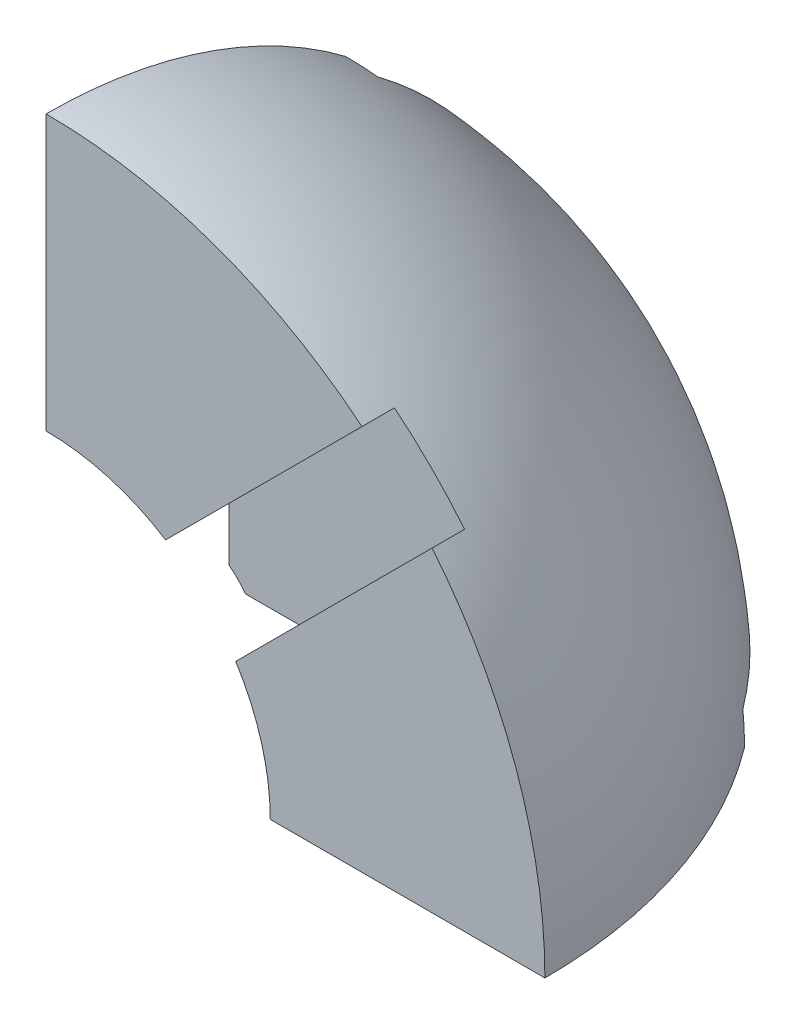
ISO-10303-21;
HEADER;
FILE_DESCRIPTION(('STEP AP214'),'2;1');
FILE_NAME('part.step','',(''),(''),'','','');
FILE_SCHEMA(('AUTOMOTIVE_DESIGN { 1 0 10303 214 1 1 1 1 }'));
ENDSEC;
DATA;
#1=APPLICATION_CONTEXT('core data for automotive mechanical design processes');
#2=APPLICATION_PROTOCOL_DEFINITION('international standard','automotive_design',2000,#1);
#3=PRODUCT_CONTEXT('',#1,'mechanical');
#4=PRODUCT('Part','Part','',(#3));
#5=PRODUCT_RELATED_PRODUCT_CATEGORY('part','',(#4));
#6=PRODUCT_DEFINITION_FORMATION('','',#4);
#7=PRODUCT_DEFINITION_CONTEXT('part definition',#1,'design');
#8=PRODUCT_DEFINITION('design','',#6,#7);
#9=PRODUCT_DEFINITION_SHAPE('','',#8);
#10=(LENGTH_UNIT() NAMED_UNIT(*) SI_UNIT(.MILLI.,.METRE.));
#11=(NAMED_UNIT(*) PLANE_ANGLE_UNIT() SI_UNIT($,.RADIAN.));
#12=(NAMED_UNIT(*) SI_UNIT($,.STERADIAN.) SOLID_ANGLE_UNIT());
#13=UNCERTAINTY_MEASURE_WITH_UNIT(LENGTH_MEASURE(1.E-05),#10,'distance_accuracy_value','');
#14=(GEOMETRIC_REPRESENTATION_CONTEXT(3) GLOBAL_UNCERTAINTY_ASSIGNED_CONTEXT((#13)) GLOBAL_UNIT_ASSIGNED_CONTEXT((#10,
#11,#12)) REPRESENTATION_CONTEXT('',''));
#15=CARTESIAN_POINT('',(0.,0.,0.));
#16=DIRECTION('',(0.,0.,1.));
#17=DIRECTION('',(1.,0.,0.));
#18=AXIS2_PLACEMENT_3D('',#15,#16,#17);
#19=CARTESIAN_POINT('',(0.,0.,0.));
#20=DIRECTION('',(-1.,0.,0.));
#21=DIRECTION('',(0.,1.,0.));
#22=AXIS2_PLACEMENT_3D('',#19,#20,#21);
#23=SPHERICAL_SURFACE('',#22,15.);
#24=CARTESIAN_POINT('',(0.,1.,0.));
#25=DIRECTION('',(0.,-1.,0.));
#26=DIRECTION('',(0.,0.,-1.));
#27=AXIS2_PLACEMENT_3D('',#24,#25,#26);
#28=CIRCLE('',#27,14.9666295470958);
#29=CARTESIAN_POINT('',(11.9761634198785,1.,-8.97616341987848));
#30=VERTEX_POINT('',#29);
#31=CARTESIAN_POINT('',(8.97616341987848,1.,-11.9761634198785));
#32=VERTEX_POINT('',#31);
#33=EDGE_CURVE('E454',#30,#32,#28,.F.);
#34=ORIENTED_EDGE('',*,*,#33,.T.);
#35=CARTESIAN_POINT('',(-1.5,0.,-1.5));
#36=DIRECTION('',(0.707106781186547,0.,0.707106781186548));
#37=DIRECTION('',(0.707106781186548,0.,-0.707106781186547));
#38=AXIS2_PLACEMENT_3D('',#35,#36,#37);
#39=CIRCLE('',#38,14.8492424049175);
#40=CARTESIAN_POINT('',(9.,0.,-12.));
#41=VERTEX_POINT('',#40);
#42=EDGE_CURVE('E304',#32,#41,#39,.F.);
#43=ORIENTED_EDGE('',*,*,#42,.T.);
#44=CARTESIAN_POINT('',(0.,0.,0.));
#45=DIRECTION('',(0.,-1.,0.));
#46=DIRECTION('',(0.,0.,-1.));
#47=AXIS2_PLACEMENT_3D('',#44,#45,#46);
#48=CIRCLE('',#47,15.);
#49=CARTESIAN_POINT('',(0.,0.,-15.));
#50=VERTEX_POINT('',#49);
#51=EDGE_CURVE('E223',#50,#41,#48,.T.);
#52=ORIENTED_EDGE('',*,*,#51,.F.);
#53=CARTESIAN_POINT('',(0.,0.,0.));
#54=DIRECTION('',(-1.,0.,0.));
#55=DIRECTION('',(0.,0.,1.));
#56=AXIS2_PLACEMENT_3D('',#53,#54,#55);
#57=CIRCLE('',#56,15.);
#58=CARTESIAN_POINT('',(0.,9.00000000000001,-12.));
#59=VERTEX_POINT('',#58);
#60=EDGE_CURVE('E248',#59,#50,#57,.T.);
#61=ORIENTED_EDGE('',*,*,#60,.F.);
#62=CARTESIAN_POINT('',(0.,-1.5,-1.49999999999999));
#63=DIRECTION('',(0.,-0.707106781186548,-0.707106781186547));
#64=DIRECTION('',(0.,0.707106781186547,-0.707106781186548));
#65=AXIS2_PLACEMENT_3D('',#62,#63,#64);
#66=CIRCLE('',#65,14.8492424049175);
#67=CARTESIAN_POINT('',(1.,8.97616341987848,-11.9761634198785));
#68=VERTEX_POINT('',#67);
#69=EDGE_CURVE('E453',#68,#59,#66,.F.);
#70=ORIENTED_EDGE('',*,*,#69,.F.);
#71=CARTESIAN_POINT('',(1.,0.,0.));
#72=DIRECTION('',(-1.,0.,0.));
#73=DIRECTION('',(0.,0.,1.));
#74=AXIS2_PLACEMENT_3D('',#71,#72,#73);
#75=CIRCLE('',#74,14.9666295470958);
#76=CARTESIAN_POINT('',(1.,11.9761634198785,-8.97616341987849));
#77=VERTEX_POINT('',#76);
#78=EDGE_CURVE('E485',#68,#77,#75,.F.);
#79=ORIENTED_EDGE('',*,*,#78,.T.);
#80=CARTESIAN_POINT('',(0.,1.49999999999999,1.49999999999999));
#81=DIRECTION('',(0.,-0.707106781186548,-0.707106781186547));
#82=DIRECTION('',(0.,0.707106781186547,-0.707106781186548));
#83=AXIS2_PLACEMENT_3D('',#80,#81,#82);
#84=CIRCLE('',#83,14.8492424049175);
#85=CARTESIAN_POINT('',(0.,12.0000000000002,-8.99999999999976));
#86=VERTEX_POINT('',#85);
#87=EDGE_CURVE('E496',#77,#86,#84,.F.);
#88=ORIENTED_EDGE('',*,*,#87,.T.);
#89=CARTESIAN_POINT('',(0.,15.,0.));
#90=VERTEX_POINT('',#89);
#91=EDGE_CURVE('E249',#90,#86,#57,.T.);
#92=ORIENTED_EDGE('',*,*,#91,.F.);
#93=CARTESIAN_POINT('',(0.,0.,0.));
#94=DIRECTION('',(0.,0.,-1.));
#95=DIRECTION('',(0.,1.,0.));
#96=AXIS2_PLACEMENT_3D('',#93,#94,#95);
#97=CIRCLE('',#96,15.);
#98=CARTESIAN_POINT('',(9.50000000000002,11.6081867662439,0.));
#99=VERTEX_POINT('',#98);
#100=EDGE_CURVE('E241',#90,#99,#97,.T.);
#101=ORIENTED_EDGE('',*,*,#100,.T.);
#102=CARTESIAN_POINT('',(-1.05409338312195,1.05409338312195,0.));
#103=DIRECTION('',(-0.707106781186547,0.707106781186548,0.));
#104=DIRECTION('',(-0.707106781186548,-0.707106781186547,0.));
#105=AXIS2_PLACEMENT_3D('',#102,#103,#104);
#106=CIRCLE('',#105,14.9257420009632);
#107=CARTESIAN_POINT('',(9.47628586644255,11.5844726326864,-0.999999999999997));
#108=VERTEX_POINT('',#107);
#109=EDGE_CURVE('E424',#108,#99,#106,.F.);
#110=ORIENTED_EDGE('',*,*,#109,.F.);
#111=CARTESIAN_POINT('',(0.,0.,-0.999999999999997));
#112=DIRECTION('',(0.,0.,1.));
#113=DIRECTION('',(1.,0.,0.));
#114=AXIS2_PLACEMENT_3D('',#111,#112,#113);
#115=CIRCLE('',#114,14.9666295470958);
#116=CARTESIAN_POINT('',(11.5844726326864,9.47628586644254,-0.999999999999997));
#117=VERTEX_POINT('',#116);
#118=EDGE_CURVE('E515',#108,#117,#115,.F.);
#119=ORIENTED_EDGE('',*,*,#118,.T.);
#120=CARTESIAN_POINT('',(1.05409338312195,-1.05409338312195,0.));
#121=DIRECTION('',(-0.707106781186547,0.707106781186548,0.));
#122=DIRECTION('',(-0.707106781186548,-0.707106781186547,0.));
#123=AXIS2_PLACEMENT_3D('',#120,#121,#122);
#124=CIRCLE('',#123,14.9257420009632);
#125=CARTESIAN_POINT('',(11.6081867662439,9.5,0.));
#126=VERTEX_POINT('',#125);
#127=EDGE_CURVE('E521',#117,#126,#124,.F.);
#128=ORIENTED_EDGE('',*,*,#127,.T.);
#129=CARTESIAN_POINT('',(15.,0.,0.));
#130=VERTEX_POINT('',#129);
#131=EDGE_CURVE('E220',#126,#130,#97,.T.);
#132=ORIENTED_EDGE('',*,*,#131,.T.);
#133=CARTESIAN_POINT('',(12.,0.,-9.));
#134=VERTEX_POINT('',#133);
#135=EDGE_CURVE('E212',#134,#130,#48,.T.);
#136=ORIENTED_EDGE('',*,*,#135,.F.);
#137=CARTESIAN_POINT('',(1.5,0.,1.5));
#138=DIRECTION('',(0.707106781186548,0.,0.707106781186547));
#139=DIRECTION('',(0.707106781186547,0.,-0.707106781186548));
#140=AXIS2_PLACEMENT_3D('',#137,#138,#139);
#141=CIRCLE('',#140,14.8492424049175);
#142=EDGE_CURVE('E194',#30,#134,#141,.F.);
#143=ORIENTED_EDGE('',*,*,#142,.F.);
#144=EDGE_LOOP('',(#34,#43,#52,#61,#70,#79,#88,#92,#101,#110,#119,#128,#132,#136,#143));
#145=FACE_BOUND('',#144,.T.);
#146=ADVANCED_FACE('F38',(#145),#23,.T.);
#147=CARTESIAN_POINT('',(0.,0.,0.));
#148=DIRECTION('',(0.,-1.,0.));
#149=DIRECTION('',(0.,0.,-1.));
#150=AXIS2_PLACEMENT_3D('',#147,#148,#149);
#151=PLANE('',#150);
#152=ORIENTED_EDGE('',*,*,#51,.T.);
#153=DIRECTION('',(-0.707106781186548,0.,0.707106781186547));
#154=VECTOR('',#153,1.);
#155=CARTESIAN_POINT('',(-1.5,0.,-1.5));
#156=LINE('',#155,#154);
#157=CARTESIAN_POINT('',(3.02566036262093,0.,-6.02566036262093));
#158=VERTEX_POINT('',#157);
#159=EDGE_CURVE('E216',#41,#158,#156,.T.);
#160=ORIENTED_EDGE('',*,*,#159,.T.);
#161=CARTESIAN_POINT('',(0.,0.,0.));
#162=DIRECTION('',(0.,-1.,0.));
#163=DIRECTION('',(0.,0.,-1.));
#164=AXIS2_PLACEMENT_3D('',#161,#162,#163);
#165=CIRCLE('',#164,6.74264068711929);
#166=CARTESIAN_POINT('',(0.,0.,-6.74264068711929));
#167=VERTEX_POINT('',#166);
#168=EDGE_CURVE('E322',#167,#158,#165,.T.);
#169=ORIENTED_EDGE('',*,*,#168,.F.);
#170=DIRECTION('',(0.,0.,-1.));
#171=VECTOR('',#170,1.);
#172=CARTESIAN_POINT('',(0.,0.,0.));
#173=LINE('',#172,#171);
#174=EDGE_CURVE('E229',#167,#50,#173,.T.);
#175=ORIENTED_EDGE('',*,*,#174,.T.);
#176=EDGE_LOOP('',(#152,#160,#169,#175));
#177=FACE_BOUND('',#176,.T.);
#178=ADVANCED_FACE('F386',(#177),#151,.T.);
#179=CARTESIAN_POINT('',(0.,0.,0.));
#180=DIRECTION('',(0.,-1.,0.));
#181=DIRECTION('',(0.,0.,1.));
#182=AXIS2_PLACEMENT_3D('',#179,#180,#181);
#183=SPHERICAL_SURFACE('',#182,6.74264068711929);
#184=ORIENTED_EDGE('',*,*,#168,.T.);
#185=CARTESIAN_POINT('',(-1.5,0.,-1.5));
#186=DIRECTION('',(0.707106781186547,0.,0.707106781186548));
#187=DIRECTION('',(0.707106781186548,0.,-0.707106781186547));
#188=AXIS2_PLACEMENT_3D('',#185,#186,#187);
#189=CIRCLE('',#188,6.40025026351286);
#190=CARTESIAN_POINT('',(3.01182753751339,0.500027978285282,-6.0118275375134));
#191=VERTEX_POINT('',#190);
#192=EDGE_CURVE('E457',#158,#191,#189,.T.);
#193=ORIENTED_EDGE('',*,*,#192,.T.);
#194=CARTESIAN_POINT('',(4.63686977199275,1.11038169210382,-4.76756695296637));
#195=CARTESIAN_POINT('',(4.57719921159137,1.05869085447477,-4.8376491363737));
#196=CARTESIAN_POINT('',(4.51438188953742,1.0092268757405,-4.90674923822128));
#197=CARTESIAN_POINT('',(4.38254898032727,0.915507297643772,-5.04276497983304));
#198=CARTESIAN_POINT('',(4.31352431815962,0.871259549923068,-5.10967721966664));
#199=CARTESIAN_POINT('',(4.16902901416115,0.78858731204365,-5.24136193971706));
#200=CARTESIAN_POINT('',(4.09351529684011,0.750207330952664,-5.30611540659265));
#201=CARTESIAN_POINT('',(3.93689743987453,0.680610672734169,-5.4325085673771));
#202=CARTESIAN_POINT('',(3.85579702121187,0.649389286532662,-5.49415028732295));
#203=CARTESIAN_POINT('',(3.64358771657519,0.580490294689324,-5.64598676370884));
#204=CARTESIAN_POINT('',(3.50892256957444,0.54828417490556,-5.73382894875738));
#205=CARTESIAN_POINT('',(3.23039141657394,0.506676373732184,-5.89894885154182));
#206=CARTESIAN_POINT('',(3.08655754429354,0.497199107179631,-5.97626077643281));
#207=CARTESIAN_POINT('',(2.81549274093602,0.503711348746555,-6.10750506905705));
#208=CARTESIAN_POINT('',(2.689038406537,0.516068027297215,-6.16320496370228));
#209=CARTESIAN_POINT('',(2.43534253360285,0.561199880476602,-6.26390361317584));
#210=CARTESIAN_POINT('',(2.30810077945468,0.593980917091554,-6.30889929066645));
#211=CARTESIAN_POINT('',(2.05632285541004,0.681096815074539,-6.38672190269653));
#212=CARTESIAN_POINT('',(1.93180664252482,0.735555505909321,-6.41947679279824));
#213=CARTESIAN_POINT('',(1.69118575313913,0.865599770468686,-6.47094762465389));
#214=CARTESIAN_POINT('',(1.57507497995203,0.941169834258349,-6.48967383584152));
#215=CARTESIAN_POINT('',(1.36826078720843,1.10193332393196,-6.51092420383107));
#216=CARTESIAN_POINT('',(1.27616759282931,1.18514103841652,-6.51500985284035));
#217=CARTESIAN_POINT('',(1.10547411193041,1.36413682607172,-6.51118601971656));
#218=CARTESIAN_POINT('',(1.02686965053478,1.45992099046565,-6.50328025650676));
#219=CARTESIAN_POINT('',(0.888505442534113,1.65635427568232,-6.47643508503675));
#220=CARTESIAN_POINT('',(0.828058422700755,1.75659230020057,-6.45800663993862));
#221=CARTESIAN_POINT('',(0.722453171851422,1.9626067591205,-6.41119247780595));
#222=CARTESIAN_POINT('',(0.677296352292865,2.06838370378669,-6.38280584201062));
#223=CARTESIAN_POINT('',(0.600747464272165,2.28748806159751,-6.3154550116933));
#224=CARTESIAN_POINT('',(0.570089876031586,2.4009382621341,-6.27606176447543));
#225=CARTESIAN_POINT('',(0.525176411907554,2.62767755717762,-6.18853724501488));
#226=CARTESIAN_POINT('',(0.510926694236386,2.740966575267,-6.14040269982458));
#227=CARTESIAN_POINT('',(0.496952760079804,2.97812935525689,-6.03042904552486));
#228=CARTESIAN_POINT('',(0.49914250952821,3.10167328606238,-5.96764282130148));
#229=CARTESIAN_POINT('',(0.52065130018437,3.34278854915233,-5.83412594483623));
#230=CARTESIAN_POINT('',(0.539978963414774,3.46035684363284,-5.76339130942176));
#231=CARTESIAN_POINT('',(0.598133724357301,3.70688047134292,-5.60273243301742));
#232=CARTESIAN_POINT('',(0.639711770791261,3.83438575834793,-5.5115881788703));
#233=CARTESIAN_POINT('',(0.739888771722207,4.07661106943627,-5.32195442236767));
#234=CARTESIAN_POINT('',(0.798497498255285,4.19132370078121,-5.22346072715767));
#235=CARTESIAN_POINT('',(0.901041822752656,4.35995327826249,-5.06463617677526));
#236=CARTESIAN_POINT('',(0.940321103574115,4.41866463761679,-5.00627511466847));
#237=CARTESIAN_POINT('',(1.02264224624261,4.5313074254305,-4.8880459229929));
#238=CARTESIAN_POINT('',(1.0656722549648,4.5852528996162,-4.8281829384037));
#239=CARTESIAN_POINT('',(1.11038169210382,4.63686977199275,-4.76756695296637));
#240=B_SPLINE_CURVE_WITH_KNOTS('',3,(#194,#195,#196,#197,#198,#199,#200,#201,#202,#203,#204,
#205,#206,#207,#208,#209,#210,#211,#212,#213,#214,#215,#216,#217,#218,#219,#220,#221,#222,#223,
#224,#225,#226,#227,#228,#229,#230,#231,#232,#233,#234,#235,#236,#237,#238,#239),.UNSPECIFIED.,
.F.,.F.,(4,2,2,2,2,2,2,2,2,2,2,2,2,2,2,2,2,2,2,2,2,2,4),(0.,0.316674287409151,0.633819316240205,
0.953261913688335,1.27249376832043,1.76238693999139,2.25064869120507,2.6651086576616,
3.07968763292575,3.49666960058281,3.91334602526578,4.28398602854311,4.65451110791419,
5.00841177761283,5.36234510742203,5.73267284755889,6.10313953407727,6.51735325771207,
6.93177548908856,7.41647696350952,7.90145710588743,8.17615495670898,8.4500141652659),.UNSPECIFIED.);
#241=CARTESIAN_POINT('',(0.500027978285282,3.0118275375134,-6.01182753751339));
#242=VERTEX_POINT('',#241);
#243=EDGE_CURVE('E309',#191,#242,#240,.T.);
#244=ORIENTED_EDGE('',*,*,#243,.T.);
#245=CARTESIAN_POINT('',(0.,-1.5,-1.49999999999999));
#246=DIRECTION('',(0.,-0.707106781186548,-0.707106781186547));
#247=DIRECTION('',(0.,0.707106781186547,-0.707106781186548));
#248=AXIS2_PLACEMENT_3D('',#245,#246,#247);
#249=CIRCLE('',#248,6.40025026351286);
#250=CARTESIAN_POINT('',(0.,3.02566036262094,-6.02566036262093));
#251=VERTEX_POINT('',#250);
#252=EDGE_CURVE('E442',#251,#242,#249,.T.);
#253=ORIENTED_EDGE('',*,*,#252,.F.);
#254=CARTESIAN_POINT('',(0.,0.,0.));
#255=DIRECTION('',(1.,0.,0.));
#256=DIRECTION('',(0.,0.,-1.));
#257=AXIS2_PLACEMENT_3D('',#254,#255,#256);
#258=CIRCLE('',#257,6.74264068711929);
#259=EDGE_CURVE('E428',#251,#167,#258,.F.);
#260=ORIENTED_EDGE('',*,*,#259,.T.);
#261=EDGE_LOOP('',(#184,#193,#244,#253,#260));
#262=FACE_BOUND('',#261,.T.);
#263=ADVANCED_FACE('F354',(#262),#183,.F.);
#264=CARTESIAN_POINT('',(3.,13.,-3.));
#265=DIRECTION('',(0.,-1.,0.));
#266=DIRECTION('',(0.,0.,-1.));
#267=AXIS2_PLACEMENT_3D('',#264,#265,#266);
#268=CYLINDRICAL_SURFACE('',#267,2.5);
#269=CARTESIAN_POINT('',(3.,1.,-3.));
#270=DIRECTION('',(0.,-1.,0.));
#271=DIRECTION('',(0.,0.,-1.));
#272=AXIS2_PLACEMENT_3D('',#269,#270,#271);
#273=CIRCLE('',#272,2.5);
#274=CARTESIAN_POINT('',(5.,1.,-4.5));
#275=VERTEX_POINT('',#274);
#276=CARTESIAN_POINT('',(4.5,1.,-5.));
#277=VERTEX_POINT('',#276);
#278=EDGE_CURVE('E54',#275,#277,#273,.F.);
#279=ORIENTED_EDGE('',*,*,#278,.F.);
#280=CARTESIAN_POINT('',(3.,3.,-3.));
#281=DIRECTION('',(-0.707106781186547,-0.707106781186547,0.));
#282=DIRECTION('',(-0.707106781186547,0.707106781186547,0.));
#283=AXIS2_PLACEMENT_3D('',#280,#281,#282);
#284=ELLIPSE('',#283,3.53553390593274,2.5);
#285=CARTESIAN_POINT('',(4.76776695296637,1.23223304703363,-4.76776695296637));
#286=VERTEX_POINT('',#285);
#287=EDGE_CURVE('E269',#286,#275,#284,.T.);
#288=ORIENTED_EDGE('',*,*,#287,.F.);
#289=CARTESIAN_POINT('',(3.,3.,-3.));
#290=DIRECTION('',(0.,-0.707106781186547,0.707106781186547));
#291=DIRECTION('',(0.,0.707106781186547,0.707106781186547));
#292=AXIS2_PLACEMENT_3D('',#289,#290,#291);
#293=ELLIPSE('',#292,3.53553390593274,2.5);
#294=EDGE_CURVE('E566',#277,#286,#293,.T.);
#295=ORIENTED_EDGE('',*,*,#294,.F.);
#296=EDGE_LOOP('',(#279,#288,#295));
#297=FACE_BOUND('',#296,.T.);
#298=ADVANCED_FACE('F370',(#297),#268,.F.);
#299=CARTESIAN_POINT('',(3.,3.,-13.));
#300=DIRECTION('',(0.,0.,1.));
#301=DIRECTION('',(1.,0.,0.));
#302=AXIS2_PLACEMENT_3D('',#299,#300,#301);
#303=CYLINDRICAL_SURFACE('',#302,2.5);
#304=CARTESIAN_POINT('',(3.,3.,-13.));
#305=DIRECTION('',(0.,0.,1.));
#306=DIRECTION('',(1.,0.,0.));
#307=AXIS2_PLACEMENT_3D('',#304,#305,#306);
#308=CIRCLE('',#307,2.5);
#309=CARTESIAN_POINT('',(5.5,3.,-13.));
#310=VERTEX_POINT('',#309);
#311=EDGE_CURVE('E224',#310,#310,#308,.T.);
#312=ORIENTED_EDGE('',*,*,#311,.F.);
#313=EDGE_LOOP('',(#312));
#314=FACE_BOUND('',#313,.T.);
#315=CARTESIAN_POINT('',(3.,3.,-6.));
#316=DIRECTION('',(0.707106781186547,0.,0.707106781186548));
#317=DIRECTION('',(-0.707106781186548,0.,0.707106781186547));
#318=AXIS2_PLACEMENT_3D('',#315,#316,#317);
#319=ELLIPSE('',#318,3.53553390593274,2.5);
#320=CARTESIAN_POINT('',(4.5,1.,-7.5));
#321=VERTEX_POINT('',#320);
#322=EDGE_CURVE('E11',#321,#191,#319,.F.);
#323=ORIENTED_EDGE('',*,*,#322,.F.);
#324=DIRECTION('',(0.,0.,1.));
#325=VECTOR('',#324,1.);
#326=CARTESIAN_POINT('',(4.5,1.,-13.));
#327=LINE('',#326,#325);
#328=EDGE_CURVE('E47',#277,#321,#327,.F.);
#329=ORIENTED_EDGE('',*,*,#328,.F.);
#330=ORIENTED_EDGE('',*,*,#294,.T.);
#331=CARTESIAN_POINT('',(3.,3.,-3.));
#332=DIRECTION('',(0.707106781186547,0.,0.707106781186547));
#333=DIRECTION('',(-0.707106781186547,0.,0.707106781186547));
#334=AXIS2_PLACEMENT_3D('',#331,#332,#333);
#335=ELLIPSE('',#334,3.53553390593274,2.5);
#336=CARTESIAN_POINT('',(4.76776695296637,4.76776695296637,-4.76776695296637));
#337=VERTEX_POINT('',#336);
#338=EDGE_CURVE('E253',#286,#337,#335,.T.);
#339=ORIENTED_EDGE('',*,*,#338,.T.);
#340=CARTESIAN_POINT('',(3.,3.,-3.));
#341=DIRECTION('',(0.,0.707106781186547,0.707106781186547));
#342=DIRECTION('',(0.,-0.707106781186547,0.707106781186547));
#343=AXIS2_PLACEMENT_3D('',#340,#341,#342);
#344=ELLIPSE('',#343,3.53553390593274,2.5);
#345=CARTESIAN_POINT('',(1.23223304703363,4.76776695296637,-4.76776695296637));
#346=VERTEX_POINT('',#345);
#347=EDGE_CURVE('E562',#337,#346,#344,.T.);
#348=ORIENTED_EDGE('',*,*,#347,.T.);
#349=CARTESIAN_POINT('',(3.,3.,-3.));
#350=DIRECTION('',(-0.707106781186547,0.,0.707106781186547));
#351=DIRECTION('',(0.707106781186547,0.,0.707106781186547));
#352=AXIS2_PLACEMENT_3D('',#349,#350,#351);
#353=ELLIPSE('',#352,3.53553390593274,2.5);
#354=CARTESIAN_POINT('',(1.,4.5,-5.));
#355=VERTEX_POINT('',#354);
#356=EDGE_CURVE('E257',#346,#355,#353,.T.);
#357=ORIENTED_EDGE('',*,*,#356,.T.);
#358=DIRECTION('',(0.,0.,1.));
#359=VECTOR('',#358,1.);
#360=CARTESIAN_POINT('',(1.,4.5,-13.));
#361=LINE('',#360,#359);
#362=CARTESIAN_POINT('',(1.,4.5,-7.5));
#363=VERTEX_POINT('',#362);
#364=EDGE_CURVE('E62',#363,#355,#361,.T.);
#365=ORIENTED_EDGE('',*,*,#364,.F.);
#366=CARTESIAN_POINT('',(3.,3.,-5.99999999999999));
#367=DIRECTION('',(0.,-0.707106781186548,-0.707106781186547));
#368=DIRECTION('',(0.,-0.707106781186547,0.707106781186548));
#369=AXIS2_PLACEMENT_3D('',#366,#367,#368);
#370=ELLIPSE('',#369,3.53553390593274,2.5);
#371=EDGE_CURVE('E286',#363,#242,#370,.F.);
#372=ORIENTED_EDGE('',*,*,#371,.T.);
#373=ORIENTED_EDGE('',*,*,#243,.F.);
#374=EDGE_LOOP('',(#323,#329,#330,#339,#348,#357,#365,#372,#373));
#375=FACE_BOUND('',#374,.T.);
#376=ADVANCED_FACE('F308',(#314,#375),#303,.F.);
#377=CARTESIAN_POINT('',(0.,0.,0.));
#378=DIRECTION('',(-1.,0.,0.));
#379=DIRECTION('',(0.,0.,1.));
#380=AXIS2_PLACEMENT_3D('',#377,#378,#379);
#381=PLANE('',#380);
#382=ORIENTED_EDGE('',*,*,#91,.T.);
#383=DIRECTION('',(0.,-0.707106781186547,0.707106781186548));
#384=VECTOR('',#383,1.);
#385=CARTESIAN_POINT('',(0.,1.49999999999999,1.49999999999999));
#386=LINE('',#385,#384);
#387=CARTESIAN_POINT('',(0.,6.02566036262093,-3.02566036262094));
#388=VERTEX_POINT('',#387);
#389=EDGE_CURVE('E205',#86,#388,#386,.T.);
#390=ORIENTED_EDGE('',*,*,#389,.T.);
#391=CARTESIAN_POINT('',(0.,6.74264068711929,0.));
#392=VERTEX_POINT('',#391);
#393=EDGE_CURVE('E433',#392,#388,#258,.F.);
#394=ORIENTED_EDGE('',*,*,#393,.F.);
#395=DIRECTION('',(0.,1.,0.));
#396=VECTOR('',#395,1.);
#397=CARTESIAN_POINT('',(0.,0.,0.));
#398=LINE('',#397,#396);
#399=EDGE_CURVE('E245',#392,#90,#398,.T.);
#400=ORIENTED_EDGE('',*,*,#399,.T.);
#401=EDGE_LOOP('',(#382,#390,#394,#400));
#402=FACE_BOUND('',#401,.T.);
#403=ADVANCED_FACE('F352',(#402),#381,.T.);
#404=ORIENTED_EDGE('',*,*,#393,.T.);
#405=CARTESIAN_POINT('',(0.,1.49999999999999,1.49999999999999));
#406=DIRECTION('',(0.,-0.707106781186548,-0.707106781186547));
#407=DIRECTION('',(0.,0.707106781186547,-0.707106781186548));
#408=AXIS2_PLACEMENT_3D('',#405,#406,#407);
#409=CIRCLE('',#408,6.40025026351286);
#410=CARTESIAN_POINT('',(0.500027978285282,6.01182753751339,-3.0118275375134));
#411=VERTEX_POINT('',#410);
#412=EDGE_CURVE('E492',#388,#411,#409,.T.);
#413=ORIENTED_EDGE('',*,*,#412,.T.);
#414=CARTESIAN_POINT('',(1.11038169210382,4.76756695296637,-4.63686977199275));
#415=CARTESIAN_POINT('',(1.05869085447477,4.8376491363737,-4.57719921159137));
#416=CARTESIAN_POINT('',(1.0092268757405,4.90674923822128,-4.51438188953742));
#417=CARTESIAN_POINT('',(0.915507297643772,5.04276497983304,-4.38254898032727));
#418=CARTESIAN_POINT('',(0.871259549923068,5.10967721966664,-4.31352431815962));
#419=CARTESIAN_POINT('',(0.788587312043649,5.24136193971706,-4.16902901416115));
#420=CARTESIAN_POINT('',(0.750207330952664,5.30611540659265,-4.09351529684011));
#421=CARTESIAN_POINT('',(0.680610672734169,5.4325085673771,-3.93689743987453));
#422=CARTESIAN_POINT('',(0.649389286532662,5.49415028732295,-3.85579702121187));
#423=CARTESIAN_POINT('',(0.580490294689323,5.64598676370884,-3.64358771657519));
#424=CARTESIAN_POINT('',(0.548284174905559,5.73382894875738,-3.50892256957444));
#425=CARTESIAN_POINT('',(0.506676373732184,5.89894885154182,-3.23039141657393));
#426=CARTESIAN_POINT('',(0.497199107179631,5.97626077643281,-3.08655754429354));
#427=CARTESIAN_POINT('',(0.503711348746555,6.10750506905705,-2.81549274093602));
#428=CARTESIAN_POINT('',(0.516068027297215,6.16320496370228,-2.689038406537));
#429=CARTESIAN_POINT('',(0.561199880476601,6.26390361317584,-2.43534253360285));
#430=CARTESIAN_POINT('',(0.593980917091554,6.30889929066645,-2.30810077945468));
#431=CARTESIAN_POINT('',(0.681096815074539,6.38672190269653,-2.05632285541004));
#432=CARTESIAN_POINT('',(0.735555505909321,6.41947679279823,-1.93180664252482));
#433=CARTESIAN_POINT('',(0.865599770468685,6.47094762465389,-1.69118575313913));
#434=CARTESIAN_POINT('',(0.941169834258348,6.48967383584152,-1.57507497995204));
#435=CARTESIAN_POINT('',(1.10193332393196,6.51092420383107,-1.36826078720843));
#436=CARTESIAN_POINT('',(1.18514103841652,6.51500985284035,-1.27616759282931));
#437=CARTESIAN_POINT('',(1.36413682607172,6.51118601971656,-1.10547411193041));
#438=CARTESIAN_POINT('',(1.45992099046565,6.50328025650676,-1.02686965053478));
#439=CARTESIAN_POINT('',(1.65635427568232,6.47643508503675,-0.888505442534115));
#440=CARTESIAN_POINT('',(1.75659230020057,6.45800663993862,-0.828058422700757));
#441=CARTESIAN_POINT('',(1.9626067591205,6.41119247780595,-0.722453171851424));
#442=CARTESIAN_POINT('',(2.06838370378669,6.38280584201062,-0.677296352292865));
#443=CARTESIAN_POINT('',(2.2874880615975,6.3154550116933,-0.600747464272166));
#444=CARTESIAN_POINT('',(2.4009382621341,6.27606176447543,-0.570089876031586));
#445=CARTESIAN_POINT('',(2.62767755717762,6.18853724501488,-0.525176411907554));
#446=CARTESIAN_POINT('',(2.740966575267,6.14040269982458,-0.510926694236386));
#447=CARTESIAN_POINT('',(2.97812935525689,6.03042904552487,-0.496952760079804));
#448=CARTESIAN_POINT('',(3.10167328606238,5.96764282130148,-0.49914250952821));
#449=CARTESIAN_POINT('',(3.34278854915233,5.83412594483624,-0.52065130018437));
#450=CARTESIAN_POINT('',(3.46035684363284,5.76339130942176,-0.539978963414773));
#451=CARTESIAN_POINT('',(3.70688047134292,5.60273243301742,-0.5981337243573));
#452=CARTESIAN_POINT('',(3.83438575834793,5.51158817887031,-0.639711770791261));
#453=CARTESIAN_POINT('',(4.07661106943627,5.32195442236767,-0.739888771722208));
#454=CARTESIAN_POINT('',(4.19132370078121,5.22346072715767,-0.798497498255285));
#455=CARTESIAN_POINT('',(4.35995327826249,5.06463617677526,-0.901041822752655));
#456=CARTESIAN_POINT('',(4.41866463761679,5.00627511466847,-0.940321103574115));
#457=CARTESIAN_POINT('',(4.5313074254305,4.8880459229929,-1.02264224624261));
#458=CARTESIAN_POINT('',(4.5852528996162,4.8281829384037,-1.0656722549648));
#459=CARTESIAN_POINT('',(4.63686977199275,4.76756695296637,-1.11038169210382));
#460=B_SPLINE_CURVE_WITH_KNOTS('',3,(#414,#415,#416,#417,#418,#419,#420,#421,#422,#423,#424,
#425,#426,#427,#428,#429,#430,#431,#432,#433,#434,#435,#436,#437,#438,#439,#440,#441,#442,#443,
#444,#445,#446,#447,#448,#449,#450,#451,#452,#453,#454,#455,#456,#457,#458,#459),.UNSPECIFIED.,
.F.,.F.,(4,2,2,2,2,2,2,2,2,2,2,2,2,2,2,2,2,2,2,2,2,2,4),(0.,0.316674287409153,0.633819316240206,
0.953261913688336,1.27249376832043,1.76238693999139,2.25064869120507,2.6651086576616,
3.07968763292575,3.49666960058281,3.91334602526578,4.2839860285431,4.65451110791419,
5.00841177761282,5.36234510742203,5.73267284755889,6.10313953407726,6.51735325771207,
6.93177548908855,7.41647696350951,7.90145710588743,8.17615495670898,8.4500141652659),.UNSPECIFIED.);
#461=CARTESIAN_POINT('',(3.57832327115225,5.68651003739615,-0.567811233879294));
#462=VERTEX_POINT('',#461);
#463=EDGE_CURVE('E314',#411,#462,#460,.T.);
#464=ORIENTED_EDGE('',*,*,#463,.T.);
#465=CARTESIAN_POINT('',(-1.05409338312195,1.05409338312195,0.));
#466=DIRECTION('',(-0.707106781186547,0.707106781186548,0.));
#467=DIRECTION('',(-0.707106781186548,-0.707106781186547,0.));
#468=AXIS2_PLACEMENT_3D('',#465,#466,#467);
#469=CIRCLE('',#468,6.57578723157262);
#470=CARTESIAN_POINT('',(3.59569035996296,5.70387712620686,0.));
#471=VERTEX_POINT('',#470);
#472=EDGE_CURVE('E429',#471,#462,#469,.T.);
#473=ORIENTED_EDGE('',*,*,#472,.F.);
#474=CARTESIAN_POINT('',(0.,0.,0.));
#475=DIRECTION('',(0.,0.,1.));
#476=DIRECTION('',(1.,0.,0.));
#477=AXIS2_PLACEMENT_3D('',#474,#475,#476);
#478=CIRCLE('',#477,6.74264068711929);
#479=EDGE_CURVE('E423',#392,#471,#478,.F.);
#480=ORIENTED_EDGE('',*,*,#479,.F.);
#481=EDGE_LOOP('',(#404,#413,#464,#473,#480));
#482=FACE_BOUND('',#481,.T.);
#483=ADVANCED_FACE('F346',(#482),#183,.F.);
#484=CARTESIAN_POINT('',(3.,13.,-3.));
#485=DIRECTION('',(0.,-1.,0.));
#486=DIRECTION('',(0.,0.,-1.));
#487=AXIS2_PLACEMENT_3D('',#484,#485,#486);
#488=CIRCLE('',#487,2.5);
#489=CARTESIAN_POINT('',(3.,13.,-5.5));
#490=VERTEX_POINT('',#489);
#491=EDGE_CURVE('E319',#490,#490,#488,.T.);
#492=ORIENTED_EDGE('',*,*,#491,.F.);
#493=EDGE_LOOP('',(#492));
#494=FACE_BOUND('',#493,.T.);
#495=CARTESIAN_POINT('',(3.,5.99999999999999,-3.));
#496=DIRECTION('',(0.,-0.707106781186548,-0.707106781186547));
#497=DIRECTION('',(0.,-0.707106781186547,0.707106781186548));
#498=AXIS2_PLACEMENT_3D('',#495,#496,#497);
#499=ELLIPSE('',#498,3.53553390593274,2.5);
#500=CARTESIAN_POINT('',(1.,7.49999999999999,-4.5));
#501=VERTEX_POINT('',#500);
#502=EDGE_CURVE('E290',#501,#411,#499,.F.);
#503=ORIENTED_EDGE('',*,*,#502,.F.);
#504=DIRECTION('',(0.,-1.,0.));
#505=VECTOR('',#504,1.);
#506=CARTESIAN_POINT('',(1.,13.,-4.5));
#507=LINE('',#506,#505);
#508=CARTESIAN_POINT('',(1.,5.,-4.5));
#509=VERTEX_POINT('',#508);
#510=EDGE_CURVE('E482',#509,#501,#507,.F.);
#511=ORIENTED_EDGE('',*,*,#510,.F.);
#512=CARTESIAN_POINT('',(3.,3.,-3.));
#513=DIRECTION('',(-0.707106781186547,-0.707106781186547,0.));
#514=DIRECTION('',(-0.707106781186547,0.707106781186547,0.));
#515=AXIS2_PLACEMENT_3D('',#512,#513,#514);
#516=ELLIPSE('',#515,3.53553390593274,2.5);
#517=EDGE_CURVE('E558',#346,#509,#516,.F.);
#518=ORIENTED_EDGE('',*,*,#517,.F.);
#519=ORIENTED_EDGE('',*,*,#347,.F.);
#520=CARTESIAN_POINT('',(3.,3.,-3.));
#521=DIRECTION('',(-0.707106781186547,0.707106781186547,0.));
#522=DIRECTION('',(-0.707106781186547,-0.707106781186547,0.));
#523=AXIS2_PLACEMENT_3D('',#520,#521,#522);
#524=ELLIPSE('',#523,3.53553390593274,2.5);
#525=CARTESIAN_POINT('',(4.76776695296637,4.76776695296637,-1.23223304703363));
#526=VERTEX_POINT('',#525);
#527=EDGE_CURVE('E265',#526,#337,#524,.T.);
#528=ORIENTED_EDGE('',*,*,#527,.F.);
#529=CARTESIAN_POINT('',(3.,3.,-3.));
#530=DIRECTION('',(0.,-0.707106781186547,0.707106781186547));
#531=DIRECTION('',(0.,0.707106781186547,0.707106781186547));
#532=AXIS2_PLACEMENT_3D('',#529,#530,#531);
#533=ELLIPSE('',#532,3.53553390593274,2.5);
#534=CARTESIAN_POINT('',(4.5,5.,-0.999999999999997));
#535=VERTEX_POINT('',#534);
#536=EDGE_CURVE('E535',#535,#526,#533,.F.);
#537=ORIENTED_EDGE('',*,*,#536,.F.);
#538=DIRECTION('',(0.,-1.,0.));
#539=VECTOR('',#538,1.);
#540=CARTESIAN_POINT('',(4.5,13.,-0.999999999999997));
#541=LINE('',#540,#539);
#542=CARTESIAN_POINT('',(4.5,6.6081867662439,-0.999999999999997));
#543=VERTEX_POINT('',#542);
#544=EDGE_CURVE('E512',#543,#535,#541,.T.);
#545=ORIENTED_EDGE('',*,*,#544,.F.);
#546=CARTESIAN_POINT('',(3.,5.1081867662439,-3.));
#547=DIRECTION('',(-0.707106781186547,0.707106781186548,0.));
#548=DIRECTION('',(-0.707106781186548,-0.707106781186547,0.));
#549=AXIS2_PLACEMENT_3D('',#546,#547,#548);
#550=ELLIPSE('',#549,3.53553390593274,2.5);
#551=EDGE_CURVE('E279',#543,#462,#550,.F.);
#552=ORIENTED_EDGE('',*,*,#551,.T.);
#553=ORIENTED_EDGE('',*,*,#463,.F.);
#554=EDGE_LOOP('',(#503,#511,#518,#519,#528,#537,#545,#552,#553));
#555=FACE_BOUND('',#554,.T.);
#556=ADVANCED_FACE('F351',(#494,#555),#268,.F.);
#557=CARTESIAN_POINT('',(13.,3.,-3.));
#558=DIRECTION('',(-1.,0.,0.));
#559=DIRECTION('',(0.,0.,1.));
#560=AXIS2_PLACEMENT_3D('',#557,#558,#559);
#561=CYLINDRICAL_SURFACE('',#560,2.5);
#562=CARTESIAN_POINT('',(1.,3.,-3.));
#563=DIRECTION('',(-1.,0.,0.));
#564=DIRECTION('',(0.,0.,1.));
#565=AXIS2_PLACEMENT_3D('',#562,#563,#564);
#566=CIRCLE('',#565,2.5);
#567=EDGE_CURVE('E283',#355,#509,#566,.F.);
#568=ORIENTED_EDGE('',*,*,#567,.F.);
#569=ORIENTED_EDGE('',*,*,#356,.F.);
#570=ORIENTED_EDGE('',*,*,#517,.T.);
#571=EDGE_LOOP('',(#568,#569,#570));
#572=FACE_BOUND('',#571,.T.);
#573=ADVANCED_FACE('F368',(#572),#561,.F.);
#574=CARTESIAN_POINT('',(0.,0.,0.));
#575=DIRECTION('',(0.,0.,-1.));
#576=DIRECTION('',(0.,1.,0.));
#577=AXIS2_PLACEMENT_3D('',#574,#575,#576);
#578=PLANE('',#577);
#579=DIRECTION('',(-0.707106781186548,-0.707106781186547,0.));
#580=VECTOR('',#579,1.);
#581=CARTESIAN_POINT('',(1.05409338312195,-1.05409338312195,0.));
#582=LINE('',#581,#580);
#583=CARTESIAN_POINT('',(5.70387712620686,3.59569035996296,0.));
#584=VERTEX_POINT('',#583);
#585=EDGE_CURVE('E411',#126,#584,#582,.T.);
#586=ORIENTED_EDGE('',*,*,#585,.T.);
#587=CARTESIAN_POINT('',(6.74264068711929,0.,0.));
#588=VERTEX_POINT('',#587);
#589=EDGE_CURVE('E413',#584,#588,#478,.F.);
#590=ORIENTED_EDGE('',*,*,#589,.T.);
#591=DIRECTION('',(1.,0.,0.));
#592=VECTOR('',#591,1.);
#593=CARTESIAN_POINT('',(0.,0.,0.));
#594=LINE('',#593,#592);
#595=EDGE_CURVE('E238',#588,#130,#594,.T.);
#596=ORIENTED_EDGE('',*,*,#595,.T.);
#597=ORIENTED_EDGE('',*,*,#131,.F.);
#598=EDGE_LOOP('',(#586,#590,#596,#597));
#599=FACE_BOUND('',#598,.T.);
#600=ADVANCED_FACE('F376',(#599),#578,.F.);
#601=CARTESIAN_POINT('',(1.5,0.,1.5));
#602=DIRECTION('',(0.707106781186548,0.,0.707106781186547));
#603=DIRECTION('',(0.707106781186547,0.,-0.707106781186548));
#604=AXIS2_PLACEMENT_3D('',#601,#602,#603);
#605=CIRCLE('',#604,6.40025026351286);
#606=CARTESIAN_POINT('',(6.02566036262093,0.,-3.02566036262093));
#607=VERTEX_POINT('',#606);
#608=CARTESIAN_POINT('',(6.0118275375134,0.500027978285282,-3.0118275375134));
#609=VERTEX_POINT('',#608);
#610=EDGE_CURVE('E206',#607,#609,#605,.T.);
#611=ORIENTED_EDGE('',*,*,#610,.F.);
#612=EDGE_CURVE('E214',#607,#588,#165,.T.);
#613=ORIENTED_EDGE('',*,*,#612,.T.);
#614=ORIENTED_EDGE('',*,*,#589,.F.);
#615=CARTESIAN_POINT('',(1.05409338312195,-1.05409338312195,0.));
#616=DIRECTION('',(-0.707106781186547,0.707106781186548,0.));
#617=DIRECTION('',(-0.707106781186548,-0.707106781186547,0.));
#618=AXIS2_PLACEMENT_3D('',#615,#616,#617);
#619=CIRCLE('',#618,6.57578723157262);
#620=CARTESIAN_POINT('',(5.68651003739615,3.57832327115225,-0.567811233879293));
#621=VERTEX_POINT('',#620);
#622=EDGE_CURVE('E420',#584,#621,#619,.T.);
#623=ORIENTED_EDGE('',*,*,#622,.T.);
#624=CARTESIAN_POINT('',(4.76756695296637,4.63686977199275,-1.11038169210382));
#625=CARTESIAN_POINT('',(4.8376491363737,4.57719921159137,-1.05869085447477));
#626=CARTESIAN_POINT('',(4.90674923822128,4.51438188953742,-1.0092268757405));
#627=CARTESIAN_POINT('',(5.04276497983304,4.38254898032727,-0.915507297643772));
#628=CARTESIAN_POINT('',(5.10967721966664,4.31352431815962,-0.871259549923069));
#629=CARTESIAN_POINT('',(5.24136193971706,4.16902901416115,-0.78858731204365));
#630=CARTESIAN_POINT('',(5.30611540659265,4.09351529684011,-0.750207330952664));
#631=CARTESIAN_POINT('',(5.4325085673771,3.93689743987453,-0.680610672734169));
#632=CARTESIAN_POINT('',(5.49415028732295,3.85579702121187,-0.649389286532663));
#633=CARTESIAN_POINT('',(5.64598676370884,3.64358771657519,-0.580490294689325));
#634=CARTESIAN_POINT('',(5.73382894875738,3.50892256957444,-0.54828417490556));
#635=CARTESIAN_POINT('',(5.89894885154182,3.23039141657393,-0.506676373732184));
#636=CARTESIAN_POINT('',(5.97626077643281,3.08655754429354,-0.497199107179631));
#637=CARTESIAN_POINT('',(6.10750506905705,2.81549274093602,-0.503711348746556));
#638=CARTESIAN_POINT('',(6.16320496370228,2.689038406537,-0.516068027297216));
#639=CARTESIAN_POINT('',(6.26390361317584,2.43534253360285,-0.561199880476603));
#640=CARTESIAN_POINT('',(6.30889929066645,2.30810077945468,-0.593980917091555));
#641=CARTESIAN_POINT('',(6.38672190269653,2.05632285541004,-0.681096815074539));
#642=CARTESIAN_POINT('',(6.41947679279823,1.93180664252482,-0.735555505909321));
#643=CARTESIAN_POINT('',(6.47094762465389,1.69118575313913,-0.865599770468686));
#644=CARTESIAN_POINT('',(6.48967383584152,1.57507497995204,-0.941169834258349));
#645=CARTESIAN_POINT('',(6.51092420383107,1.36826078720843,-1.10193332393196));
#646=CARTESIAN_POINT('',(6.51500985284035,1.27616759282931,-1.18514103841652));
#647=CARTESIAN_POINT('',(6.51118601971656,1.10547411193041,-1.36413682607172));
#648=CARTESIAN_POINT('',(6.50328025650677,1.02686965053478,-1.45992099046565));
#649=CARTESIAN_POINT('',(6.47643508503675,0.888505442534115,-1.65635427568232));
#650=CARTESIAN_POINT('',(6.45800663993862,0.828058422700757,-1.75659230020057));
#651=CARTESIAN_POINT('',(6.41119247780595,0.722453171851424,-1.9626067591205));
#652=CARTESIAN_POINT('',(6.38280584201062,0.677296352292866,-2.06838370378669));
#653=CARTESIAN_POINT('',(6.3154550116933,0.600747464272166,-2.2874880615975));
#654=CARTESIAN_POINT('',(6.27606176447543,0.570089876031587,-2.4009382621341));
#655=CARTESIAN_POINT('',(6.18853724501488,0.525176411907556,-2.62767755717762));
#656=CARTESIAN_POINT('',(6.14040269982458,0.510926694236387,-2.740966575267));
#657=CARTESIAN_POINT('',(6.03042904552487,0.496952760079804,-2.97812935525689));
#658=CARTESIAN_POINT('',(5.96764282130148,0.499142509528211,-3.10167328606238));
#659=CARTESIAN_POINT('',(5.83412594483623,0.520651300184371,-3.34278854915233));
#660=CARTESIAN_POINT('',(5.76339130942176,0.539978963414775,-3.46035684363284));
#661=CARTESIAN_POINT('',(5.60273243301742,0.598133724357301,-3.70688047134292));
#662=CARTESIAN_POINT('',(5.5115881788703,0.639711770791262,-3.83438575834793));
#663=CARTESIAN_POINT('',(5.32195442236767,0.739888771722209,-4.07661106943627));
#664=CARTESIAN_POINT('',(5.22346072715767,0.798497498255286,-4.19132370078122));
#665=CARTESIAN_POINT('',(5.06463617677526,0.901041822752657,-4.35995327826249));
#666=CARTESIAN_POINT('',(5.00627511466847,0.940321103574116,-4.41866463761679));
#667=CARTESIAN_POINT('',(4.8880459229929,1.02264224624262,-4.5313074254305));
#668=CARTESIAN_POINT('',(4.8281829384037,1.0656722549648,-4.58525289961619));
#669=CARTESIAN_POINT('',(4.76756695296637,1.11038169210382,-4.63686977199275));
#670=B_SPLINE_CURVE_WITH_KNOTS('',3,(#624,#625,#626,#627,#628,#629,#630,#631,#632,#633,#634,
#635,#636,#637,#638,#639,#640,#641,#642,#643,#644,#645,#646,#647,#648,#649,#650,#651,#652,#653,
#654,#655,#656,#657,#658,#659,#660,#661,#662,#663,#664,#665,#666,#667,#668,#669),.UNSPECIFIED.,
.F.,.F.,(4,2,2,2,2,2,2,2,2,2,2,2,2,2,2,2,2,2,2,2,2,2,4),(0.,0.316674287409153,0.633819316240206,
0.953261913688335,1.27249376832043,1.76238693999139,2.25064869120507,2.6651086576616,
3.07968763292575,3.49666960058281,3.91334602526578,4.2839860285431,4.65451110791419,
5.00841177761282,5.36234510742203,5.73267284755889,6.10313953407726,6.51735325771207,
6.93177548908855,7.41647696350951,7.90145710588743,8.17615495670898,8.4500141652659),.UNSPECIFIED.);
#671=EDGE_CURVE('E315',#621,#609,#670,.T.);
#672=ORIENTED_EDGE('',*,*,#671,.T.);
#673=EDGE_LOOP('',(#611,#613,#614,#623,#672));
#674=FACE_BOUND('',#673,.T.);
#675=ADVANCED_FACE('F355',(#674),#183,.F.);
#676=CARTESIAN_POINT('',(13.,3.,-3.));
#677=DIRECTION('',(-1.,0.,0.));
#678=DIRECTION('',(0.,0.,1.));
#679=AXIS2_PLACEMENT_3D('',#676,#677,#678);
#680=CIRCLE('',#679,2.5);
#681=CARTESIAN_POINT('',(13.,3.,-0.5));
#682=VERTEX_POINT('',#681);
#683=EDGE_CURVE('E231',#682,#682,#680,.T.);
#684=ORIENTED_EDGE('',*,*,#683,.F.);
#685=EDGE_LOOP('',(#684));
#686=FACE_BOUND('',#685,.T.);
#687=DIRECTION('',(-1.,0.,0.));
#688=VECTOR('',#687,1.);
#689=CARTESIAN_POINT('',(13.,1.,-4.5));
#690=LINE('',#689,#688);
#691=CARTESIAN_POINT('',(7.5,1.,-4.5));
#692=VERTEX_POINT('',#691);
#693=EDGE_CURVE('E594',#692,#275,#690,.T.);
#694=ORIENTED_EDGE('',*,*,#693,.F.);
#695=CARTESIAN_POINT('',(6.,3.,-3.));
#696=DIRECTION('',(0.707106781186548,0.,0.707106781186547));
#697=DIRECTION('',(-0.707106781186547,0.,0.707106781186548));
#698=AXIS2_PLACEMENT_3D('',#695,#696,#697);
#699=ELLIPSE('',#698,3.53553390593274,2.5);
#700=EDGE_CURVE('E456',#692,#609,#699,.F.);
#701=ORIENTED_EDGE('',*,*,#700,.T.);
#702=ORIENTED_EDGE('',*,*,#671,.F.);
#703=CARTESIAN_POINT('',(5.1081867662439,3.,-3.));
#704=DIRECTION('',(-0.707106781186547,0.707106781186548,0.));
#705=DIRECTION('',(-0.707106781186548,-0.707106781186547,0.));
#706=AXIS2_PLACEMENT_3D('',#703,#704,#705);
#707=ELLIPSE('',#706,3.53553390593274,2.5);
#708=CARTESIAN_POINT('',(6.6081867662439,4.5,-0.999999999999997));
#709=VERTEX_POINT('',#708);
#710=EDGE_CURVE('E276',#709,#621,#707,.F.);
#711=ORIENTED_EDGE('',*,*,#710,.F.);
#712=DIRECTION('',(-1.,0.,0.));
#713=VECTOR('',#712,1.);
#714=CARTESIAN_POINT('',(13.,4.5,-0.999999999999997));
#715=LINE('',#714,#713);
#716=CARTESIAN_POINT('',(5.,4.5,-0.999999999999998));
#717=VERTEX_POINT('',#716);
#718=EDGE_CURVE('E507',#717,#709,#715,.F.);
#719=ORIENTED_EDGE('',*,*,#718,.F.);
#720=CARTESIAN_POINT('',(3.,3.,-3.));
#721=DIRECTION('',(-0.707106781186547,0.,0.707106781186547));
#722=DIRECTION('',(0.707106781186547,0.,0.707106781186547));
#723=AXIS2_PLACEMENT_3D('',#720,#721,#722);
#724=ELLIPSE('',#723,3.53553390593274,2.5);
#725=EDGE_CURVE('E261',#526,#717,#724,.F.);
#726=ORIENTED_EDGE('',*,*,#725,.F.);
#727=ORIENTED_EDGE('',*,*,#527,.T.);
#728=ORIENTED_EDGE('',*,*,#338,.F.);
#729=ORIENTED_EDGE('',*,*,#287,.T.);
#730=EDGE_LOOP('',(#694,#701,#702,#711,#719,#726,#727,#728,#729));
#731=FACE_BOUND('',#730,.T.);
#732=ADVANCED_FACE('F378',(#686,#731),#561,.F.);
#733=CARTESIAN_POINT('',(3.,3.,-0.999999999999997));
#734=DIRECTION('',(0.,0.,1.));
#735=DIRECTION('',(1.,0.,0.));
#736=AXIS2_PLACEMENT_3D('',#733,#734,#735);
#737=CIRCLE('',#736,2.5);
#738=EDGE_CURVE('E273',#535,#717,#737,.F.);
#739=ORIENTED_EDGE('',*,*,#738,.F.);
#740=ORIENTED_EDGE('',*,*,#536,.T.);
#741=ORIENTED_EDGE('',*,*,#725,.T.);
#742=EDGE_LOOP('',(#739,#740,#741));
#743=FACE_BOUND('',#742,.T.);
#744=ADVANCED_FACE('F342',(#743),#303,.F.);
#745=DIRECTION('',(0.,-0.707106781186547,0.707106781186548));
#746=VECTOR('',#745,1.);
#747=CARTESIAN_POINT('',(0.,-1.5,-1.49999999999999));
#748=LINE('',#747,#746);
#749=EDGE_CURVE('E448',#59,#251,#748,.T.);
#750=ORIENTED_EDGE('',*,*,#749,.F.);
#751=ORIENTED_EDGE('',*,*,#60,.T.);
#752=ORIENTED_EDGE('',*,*,#174,.F.);
#753=ORIENTED_EDGE('',*,*,#259,.F.);
#754=EDGE_LOOP('',(#750,#751,#752,#753));
#755=FACE_BOUND('',#754,.T.);
#756=ADVANCED_FACE('F40',(#755),#381,.T.);
#757=ORIENTED_EDGE('',*,*,#479,.T.);
#758=DIRECTION('',(-0.707106781186548,-0.707106781186547,0.));
#759=VECTOR('',#758,1.);
#760=CARTESIAN_POINT('',(-1.05409338312195,1.05409338312195,0.));
#761=LINE('',#760,#759);
#762=EDGE_CURVE('E417',#99,#471,#761,.T.);
#763=ORIENTED_EDGE('',*,*,#762,.F.);
#764=ORIENTED_EDGE('',*,*,#100,.F.);
#765=ORIENTED_EDGE('',*,*,#399,.F.);
#766=EDGE_LOOP('',(#757,#763,#764,#765));
#767=FACE_BOUND('',#766,.T.);
#768=ADVANCED_FACE('F385',(#767),#578,.F.);
#769=DIRECTION('',(-0.707106781186547,0.,0.707106781186548));
#770=VECTOR('',#769,1.);
#771=CARTESIAN_POINT('',(1.5,0.,1.5));
#772=LINE('',#771,#770);
#773=EDGE_CURVE('E197',#134,#607,#772,.T.);
#774=ORIENTED_EDGE('',*,*,#773,.F.);
#775=ORIENTED_EDGE('',*,*,#135,.T.);
#776=ORIENTED_EDGE('',*,*,#595,.F.);
#777=ORIENTED_EDGE('',*,*,#612,.F.);
#778=EDGE_LOOP('',(#774,#775,#776,#777));
#779=FACE_BOUND('',#778,.T.);
#780=ADVANCED_FACE('F210',(#779),#151,.T.);
#781=CARTESIAN_POINT('',(3.,3.,-13.));
#782=DIRECTION('',(0.,0.,1.));
#783=DIRECTION('',(1.,0.,0.));
#784=AXIS2_PLACEMENT_3D('',#781,#782,#783);
#785=PLANE('',#784);
#786=ORIENTED_EDGE('',*,*,#311,.T.);
#787=EDGE_LOOP('',(#786));
#788=FACE_BOUND('',#787,.T.);
#789=ADVANCED_FACE('F372',(#788),#785,.T.);
#790=CARTESIAN_POINT('',(13.,3.,-3.));
#791=DIRECTION('',(-1.,0.,0.));
#792=DIRECTION('',(0.,0.,1.));
#793=AXIS2_PLACEMENT_3D('',#790,#791,#792);
#794=PLANE('',#793);
#795=ORIENTED_EDGE('',*,*,#683,.T.);
#796=EDGE_LOOP('',(#795));
#797=FACE_BOUND('',#796,.T.);
#798=ADVANCED_FACE('F363',(#797),#794,.T.);
#799=CARTESIAN_POINT('',(3.,13.,-3.));
#800=DIRECTION('',(0.,-1.,0.));
#801=DIRECTION('',(0.,0.,-1.));
#802=AXIS2_PLACEMENT_3D('',#799,#800,#801);
#803=PLANE('',#802);
#804=ORIENTED_EDGE('',*,*,#491,.T.);
#805=EDGE_LOOP('',(#804));
#806=FACE_BOUND('',#805,.T.);
#807=ADVANCED_FACE('F358',(#806),#803,.T.);
#808=CARTESIAN_POINT('',(0.,0.,-0.999999999999997));
#809=DIRECTION('',(0.,0.,1.));
#810=DIRECTION('',(1.,0.,0.));
#811=AXIS2_PLACEMENT_3D('',#808,#809,#810);
#812=PLANE('',#811);
#813=DIRECTION('',(-0.707106781186548,-0.707106781186547,0.));
#814=VECTOR('',#813,1.);
#815=CARTESIAN_POINT('',(-1.05409338312195,1.05409338312195,-0.999999999999997));
#816=LINE('',#815,#814);
#817=EDGE_CURVE('E416',#108,#543,#816,.T.);
#818=ORIENTED_EDGE('',*,*,#817,.T.);
#819=ORIENTED_EDGE('',*,*,#544,.T.);
#820=ORIENTED_EDGE('',*,*,#738,.T.);
#821=ORIENTED_EDGE('',*,*,#718,.T.);
#822=DIRECTION('',(-0.707106781186548,-0.707106781186547,0.));
#823=VECTOR('',#822,1.);
#824=CARTESIAN_POINT('',(1.05409338312195,-1.05409338312195,-0.999999999999997));
#825=LINE('',#824,#823);
#826=EDGE_CURVE('E503',#117,#709,#825,.T.);
#827=ORIENTED_EDGE('',*,*,#826,.F.);
#828=ORIENTED_EDGE('',*,*,#118,.F.);
#829=EDGE_LOOP('',(#818,#819,#820,#821,#827,#828));
#830=FACE_BOUND('',#829,.T.);
#831=ADVANCED_FACE('F362',(#830),#812,.T.);
#832=CARTESIAN_POINT('',(1.05409338312195,-1.05409338312195,-0.999999999999997));
#833=DIRECTION('',(-0.707106781186547,0.707106781186548,0.));
#834=DIRECTION('',(-0.707106781186548,-0.707106781186547,0.));
#835=AXIS2_PLACEMENT_3D('',#832,#833,#834);
#836=PLANE('',#835);
#837=ORIENTED_EDGE('',*,*,#826,.T.);
#838=ORIENTED_EDGE('',*,*,#710,.T.);
#839=ORIENTED_EDGE('',*,*,#622,.F.);
#840=ORIENTED_EDGE('',*,*,#585,.F.);
#841=ORIENTED_EDGE('',*,*,#127,.F.);
#842=EDGE_LOOP('',(#837,#838,#839,#840,#841));
#843=FACE_BOUND('',#842,.T.);
#844=ADVANCED_FACE('F546',(#843),#836,.T.);
#845=CARTESIAN_POINT('',(-1.05409338312195,1.05409338312195,-0.999999999999997));
#846=DIRECTION('',(-0.707106781186547,0.707106781186548,0.));
#847=DIRECTION('',(-0.707106781186548,-0.707106781186547,0.));
#848=AXIS2_PLACEMENT_3D('',#845,#846,#847);
#849=PLANE('',#848);
#850=ORIENTED_EDGE('',*,*,#109,.T.);
#851=ORIENTED_EDGE('',*,*,#762,.T.);
#852=ORIENTED_EDGE('',*,*,#472,.T.);
#853=ORIENTED_EDGE('',*,*,#551,.F.);
#854=ORIENTED_EDGE('',*,*,#817,.F.);
#855=EDGE_LOOP('',(#850,#851,#852,#853,#854));
#856=FACE_BOUND('',#855,.T.);
#857=ADVANCED_FACE('F356',(#856),#849,.F.);
#858=CARTESIAN_POINT('',(1.,0.,0.));
#859=DIRECTION('',(-1.,0.,0.));
#860=DIRECTION('',(0.,0.,1.));
#861=AXIS2_PLACEMENT_3D('',#858,#859,#860);
#862=PLANE('',#861);
#863=DIRECTION('',(0.,-0.707106781186547,0.707106781186548));
#864=VECTOR('',#863,1.);
#865=CARTESIAN_POINT('',(1.,-1.5,-1.49999999999999));
#866=LINE('',#865,#864);
#867=EDGE_CURVE('E472',#68,#363,#866,.T.);
#868=ORIENTED_EDGE('',*,*,#867,.T.);
#869=ORIENTED_EDGE('',*,*,#364,.T.);
#870=ORIENTED_EDGE('',*,*,#567,.T.);
#871=ORIENTED_EDGE('',*,*,#510,.T.);
#872=DIRECTION('',(0.,-0.707106781186547,0.707106781186548));
#873=VECTOR('',#872,1.);
#874=CARTESIAN_POINT('',(1.,1.49999999999999,1.49999999999999));
#875=LINE('',#874,#873);
#876=EDGE_CURVE('E468',#77,#501,#875,.T.);
#877=ORIENTED_EDGE('',*,*,#876,.F.);
#878=ORIENTED_EDGE('',*,*,#78,.F.);
#879=EDGE_LOOP('',(#868,#869,#870,#871,#877,#878));
#880=FACE_BOUND('',#879,.T.);
#881=ADVANCED_FACE('F622',(#880),#862,.T.);
#882=CARTESIAN_POINT('',(1.,1.49999999999999,1.49999999999999));
#883=DIRECTION('',(0.,-0.707106781186548,-0.707106781186547));
#884=DIRECTION('',(0.,0.707106781186547,-0.707106781186548));
#885=AXIS2_PLACEMENT_3D('',#882,#883,#884);
#886=PLANE('',#885);
#887=ORIENTED_EDGE('',*,*,#876,.T.);
#888=ORIENTED_EDGE('',*,*,#502,.T.);
#889=ORIENTED_EDGE('',*,*,#412,.F.);
#890=ORIENTED_EDGE('',*,*,#389,.F.);
#891=ORIENTED_EDGE('',*,*,#87,.F.);
#892=EDGE_LOOP('',(#887,#888,#889,#890,#891));
#893=FACE_BOUND('',#892,.T.);
#894=ADVANCED_FACE('F554',(#893),#886,.T.);
#895=CARTESIAN_POINT('',(1.,-1.5,-1.49999999999999));
#896=DIRECTION('',(0.,-0.707106781186548,-0.707106781186547));
#897=DIRECTION('',(0.,0.707106781186547,-0.707106781186548));
#898=AXIS2_PLACEMENT_3D('',#895,#896,#897);
#899=PLANE('',#898);
#900=ORIENTED_EDGE('',*,*,#69,.T.);
#901=ORIENTED_EDGE('',*,*,#749,.T.);
#902=ORIENTED_EDGE('',*,*,#252,.T.);
#903=ORIENTED_EDGE('',*,*,#371,.F.);
#904=ORIENTED_EDGE('',*,*,#867,.F.);
#905=EDGE_LOOP('',(#900,#901,#902,#903,#904));
#906=FACE_BOUND('',#905,.T.);
#907=ADVANCED_FACE('F632',(#906),#899,.F.);
#908=CARTESIAN_POINT('',(0.,1.,0.));
#909=DIRECTION('',(0.,-1.,0.));
#910=DIRECTION('',(0.,0.,-1.));
#911=AXIS2_PLACEMENT_3D('',#908,#909,#910);
#912=PLANE('',#911);
#913=DIRECTION('',(-0.707106781186547,0.,0.707106781186548));
#914=VECTOR('',#913,1.);
#915=CARTESIAN_POINT('',(1.5,1.,1.5));
#916=LINE('',#915,#914);
#917=EDGE_CURVE('E200',#30,#692,#916,.T.);
#918=ORIENTED_EDGE('',*,*,#917,.T.);
#919=ORIENTED_EDGE('',*,*,#693,.T.);
#920=ORIENTED_EDGE('',*,*,#278,.T.);
#921=ORIENTED_EDGE('',*,*,#328,.T.);
#922=DIRECTION('',(-0.707106781186548,0.,0.707106781186547));
#923=VECTOR('',#922,1.);
#924=CARTESIAN_POINT('',(-1.5,1.,-1.5));
#925=LINE('',#924,#923);
#926=EDGE_CURVE('E296',#32,#321,#925,.T.);
#927=ORIENTED_EDGE('',*,*,#926,.F.);
#928=ORIENTED_EDGE('',*,*,#33,.F.);
#929=EDGE_LOOP('',(#918,#919,#920,#921,#927,#928));
#930=FACE_BOUND('',#929,.T.);
#931=ADVANCED_FACE('F295',(#930),#912,.T.);
#932=CARTESIAN_POINT('',(-1.5,1.,-1.5));
#933=DIRECTION('',(0.707106781186547,0.,0.707106781186548));
#934=DIRECTION('',(0.707106781186548,0.,-0.707106781186547));
#935=AXIS2_PLACEMENT_3D('',#932,#933,#934);
#936=PLANE('',#935);
#937=ORIENTED_EDGE('',*,*,#926,.T.);
#938=ORIENTED_EDGE('',*,*,#322,.T.);
#939=ORIENTED_EDGE('',*,*,#192,.F.);
#940=ORIENTED_EDGE('',*,*,#159,.F.);
#941=ORIENTED_EDGE('',*,*,#42,.F.);
#942=EDGE_LOOP('',(#937,#938,#939,#940,#941));
#943=FACE_BOUND('',#942,.T.);
#944=ADVANCED_FACE('F301',(#943),#936,.T.);
#945=CARTESIAN_POINT('',(1.5,1.,1.5));
#946=DIRECTION('',(0.707106781186548,0.,0.707106781186547));
#947=DIRECTION('',(0.707106781186547,0.,-0.707106781186548));
#948=AXIS2_PLACEMENT_3D('',#945,#946,#947);
#949=PLANE('',#948);
#950=ORIENTED_EDGE('',*,*,#142,.T.);
#951=ORIENTED_EDGE('',*,*,#773,.T.);
#952=ORIENTED_EDGE('',*,*,#610,.T.);
#953=ORIENTED_EDGE('',*,*,#700,.F.);
#954=ORIENTED_EDGE('',*,*,#917,.F.);
#955=EDGE_LOOP('',(#950,#951,#952,#953,#954));
#956=FACE_BOUND('',#955,.T.);
#957=ADVANCED_FACE('F196',(#956),#949,.F.);
#958=CLOSED_SHELL('',(#146,#178,#263,#298,#376,#403,#483,#556,#573,#600,#675,#732,#744,#756,
#768,#780,#789,#798,#807,#831,#844,#857,#881,#894,#907,#931,#944,#957));
#959=MANIFOLD_SOLID_BREP('B2',#958);
#960=ADVANCED_BREP_SHAPE_REPRESENTATION('',(#18,#959),#14);
#961=SHAPE_DEFINITION_REPRESENTATION(#9,#960);
ENDSEC;
END-ISO-10303-21;
